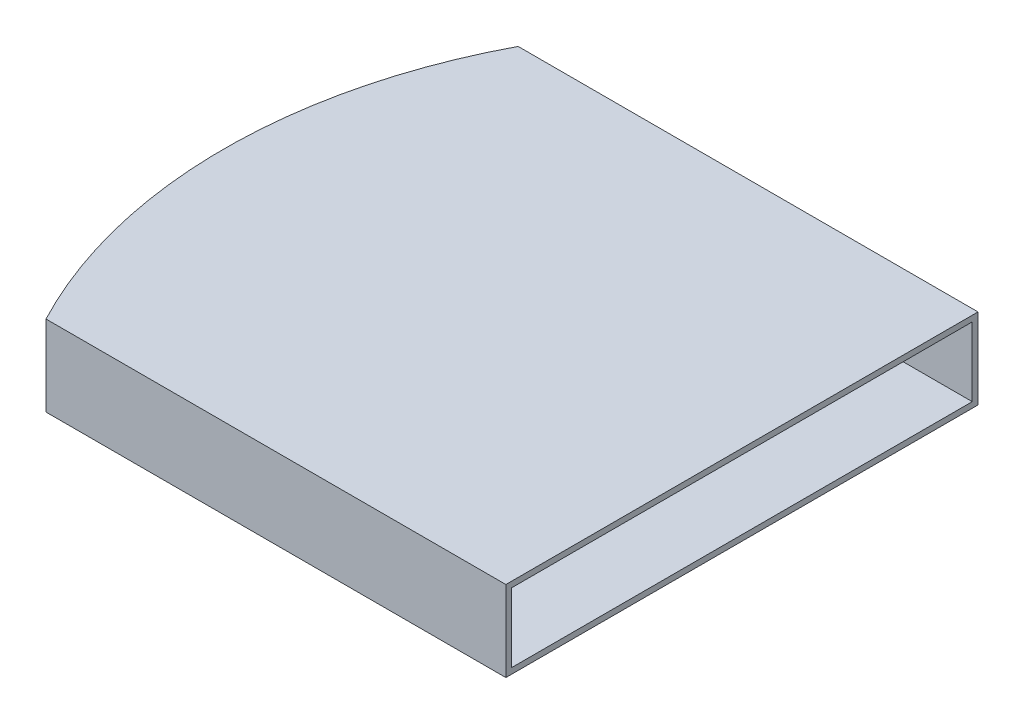
ISO-10303-21;
HEADER;
FILE_DESCRIPTION(('STEP AP214'),'2;1');
FILE_NAME('part.step','',(''),(''),'','','');
FILE_SCHEMA(('AUTOMOTIVE_DESIGN { 1 0 10303 214 1 1 1 1 }'));
ENDSEC;
DATA;
#1=APPLICATION_CONTEXT('core data for automotive mechanical design processes');
#2=APPLICATION_PROTOCOL_DEFINITION('international standard','automotive_design',2000,#1);
#3=PRODUCT_CONTEXT('',#1,'mechanical');
#4=PRODUCT('Part','Part','',(#3));
#5=PRODUCT_RELATED_PRODUCT_CATEGORY('part','',(#4));
#6=PRODUCT_DEFINITION_FORMATION('','',#4);
#7=PRODUCT_DEFINITION_CONTEXT('part definition',#1,'design');
#8=PRODUCT_DEFINITION('design','',#6,#7);
#9=PRODUCT_DEFINITION_SHAPE('','',#8);
#10=(LENGTH_UNIT() NAMED_UNIT(*) SI_UNIT(.MILLI.,.METRE.));
#11=(NAMED_UNIT(*) PLANE_ANGLE_UNIT() SI_UNIT($,.RADIAN.));
#12=(NAMED_UNIT(*) SI_UNIT($,.STERADIAN.) SOLID_ANGLE_UNIT());
#13=UNCERTAINTY_MEASURE_WITH_UNIT(LENGTH_MEASURE(1.E-05),#10,'distance_accuracy_value','');
#14=(GEOMETRIC_REPRESENTATION_CONTEXT(3) GLOBAL_UNCERTAINTY_ASSIGNED_CONTEXT((#13)) GLOBAL_UNIT_ASSIGNED_CONTEXT((#10,
#11,#12)) REPRESENTATION_CONTEXT('',''));
#15=CARTESIAN_POINT('',(0.,0.,0.));
#16=DIRECTION('',(0.,0.,1.));
#17=DIRECTION('',(1.,0.,0.));
#18=AXIS2_PLACEMENT_3D('',#15,#16,#17);
#19=CARTESIAN_POINT('',(-6.35000000000002,44.45,-130.175));
#20=DIRECTION('',(0.,-1.,0.));
#21=DIRECTION('',(0.,0.,-1.));
#22=AXIS2_PLACEMENT_3D('',#19,#20,#21);
#23=CYLINDRICAL_SURFACE('',#22,279.4);
#24=CARTESIAN_POINT('',(-6.35000000000002,0.,-130.175));
#25=DIRECTION('',(0.,1.,0.));
#26=DIRECTION('',(0.,0.,1.));
#27=AXIS2_PLACEMENT_3D('',#24,#25,#26);
#28=CIRCLE('',#27,279.4);
#29=CARTESIAN_POINT('',(-253.572226700999,0.,-260.35));
#30=VERTEX_POINT('',#29);
#31=CARTESIAN_POINT('',(-253.572226700999,0.,0.));
#32=VERTEX_POINT('',#31);
#33=EDGE_CURVE('E150',#30,#32,#28,.T.);
#34=ORIENTED_EDGE('',*,*,#33,.T.);
#35=DIRECTION('',(0.,-1.,0.));
#36=VECTOR('',#35,1.);
#37=CARTESIAN_POINT('',(-253.572226700999,44.45,0.));
#38=LINE('',#37,#36);
#39=CARTESIAN_POINT('',(-253.572226700999,44.45,0.));
#40=VERTEX_POINT('',#39);
#41=EDGE_CURVE('E183',#40,#32,#38,.T.);
#42=ORIENTED_EDGE('',*,*,#41,.F.);
#43=CARTESIAN_POINT('',(-6.35000000000002,44.45,-130.175));
#44=DIRECTION('',(0.,1.,0.));
#45=DIRECTION('',(0.,0.,1.));
#46=AXIS2_PLACEMENT_3D('',#43,#44,#45);
#47=CIRCLE('',#46,279.4);
#48=CARTESIAN_POINT('',(-253.572226700999,44.45,-260.35));
#49=VERTEX_POINT('',#48);
#50=EDGE_CURVE('E152',#49,#40,#47,.T.);
#51=ORIENTED_EDGE('',*,*,#50,.F.);
#52=DIRECTION('',(0.,-1.,0.));
#53=VECTOR('',#52,1.);
#54=CARTESIAN_POINT('',(-253.572226700999,44.45,-260.35));
#55=LINE('',#54,#53);
#56=EDGE_CURVE('E162',#49,#30,#55,.T.);
#57=ORIENTED_EDGE('',*,*,#56,.T.);
#58=EDGE_LOOP('',(#34,#42,#51,#57));
#59=FACE_BOUND('',#58,.T.);
#60=ADVANCED_FACE('F39',(#59),#23,.T.);
#61=CARTESIAN_POINT('',(-253.572226700999,44.45,0.));
#62=DIRECTION('',(0.,0.,-1.));
#63=DIRECTION('',(-1.,0.,0.));
#64=AXIS2_PLACEMENT_3D('',#61,#62,#63);
#65=PLANE('',#64);
#66=DIRECTION('',(1.,0.,0.));
#67=VECTOR('',#66,1.);
#68=CARTESIAN_POINT('',(-253.572226700999,0.,0.));
#69=LINE('',#68,#67);
#70=CARTESIAN_POINT('',(0.,0.,0.));
#71=VERTEX_POINT('',#70);
#72=EDGE_CURVE('E166',#32,#71,#69,.T.);
#73=ORIENTED_EDGE('',*,*,#72,.T.);
#74=DIRECTION('',(0.,-1.,0.));
#75=VECTOR('',#74,1.);
#76=CARTESIAN_POINT('',(0.,44.45,0.));
#77=LINE('',#76,#75);
#78=CARTESIAN_POINT('',(0.,44.45,0.));
#79=VERTEX_POINT('',#78);
#80=EDGE_CURVE('E179',#79,#71,#77,.T.);
#81=ORIENTED_EDGE('',*,*,#80,.F.);
#82=DIRECTION('',(1.,0.,0.));
#83=VECTOR('',#82,1.);
#84=CARTESIAN_POINT('',(-253.572226700999,44.45,0.));
#85=LINE('',#84,#83);
#86=EDGE_CURVE('E92',#40,#79,#85,.T.);
#87=ORIENTED_EDGE('',*,*,#86,.F.);
#88=ORIENTED_EDGE('',*,*,#41,.T.);
#89=EDGE_LOOP('',(#73,#81,#87,#88));
#90=FACE_BOUND('',#89,.T.);
#91=ADVANCED_FACE('F213',(#90),#65,.F.);
#92=CARTESIAN_POINT('',(0.,44.45,-260.35));
#93=DIRECTION('',(-1.,0.,0.));
#94=DIRECTION('',(0.,0.,1.));
#95=AXIS2_PLACEMENT_3D('',#92,#93,#94);
#96=PLANE('',#95);
#97=DIRECTION('',(0.,0.,-1.));
#98=VECTOR('',#97,1.);
#99=CARTESIAN_POINT('',(0.,41.275,-260.35));
#100=LINE('',#99,#98);
#101=CARTESIAN_POINT('',(0.,41.275,-3.17499999999998));
#102=VERTEX_POINT('',#101);
#103=CARTESIAN_POINT('',(0.,41.275,-257.175));
#104=VERTEX_POINT('',#103);
#105=EDGE_CURVE('E47',#102,#104,#100,.T.);
#106=ORIENTED_EDGE('',*,*,#105,.T.);
#107=DIRECTION('',(0.,-1.,0.));
#108=VECTOR('',#107,1.);
#109=CARTESIAN_POINT('',(0.,44.45,-257.175));
#110=LINE('',#109,#108);
#111=CARTESIAN_POINT('',(0.,3.175,-257.175));
#112=VERTEX_POINT('',#111);
#113=EDGE_CURVE('E11',#104,#112,#110,.T.);
#114=ORIENTED_EDGE('',*,*,#113,.T.);
#115=DIRECTION('',(0.,0.,1.));
#116=VECTOR('',#115,1.);
#117=CARTESIAN_POINT('',(0.,3.175,-260.35));
#118=LINE('',#117,#116);
#119=CARTESIAN_POINT('',(0.,3.175,-3.175));
#120=VERTEX_POINT('',#119);
#121=EDGE_CURVE('E189',#112,#120,#118,.T.);
#122=ORIENTED_EDGE('',*,*,#121,.T.);
#123=DIRECTION('',(0.,-1.,0.));
#124=VECTOR('',#123,1.);
#125=CARTESIAN_POINT('',(0.,44.45,-3.17499999999998));
#126=LINE('',#125,#124);
#127=EDGE_CURVE('E186',#102,#120,#126,.T.);
#128=ORIENTED_EDGE('',*,*,#127,.F.);
#129=EDGE_LOOP('',(#106,#114,#122,#128));
#130=FACE_BOUND('',#129,.T.);
#131=DIRECTION('',(0.,0.,-1.));
#132=VECTOR('',#131,1.);
#133=CARTESIAN_POINT('',(0.,0.,-260.35));
#134=LINE('',#133,#132);
#135=CARTESIAN_POINT('',(0.,0.,-260.35));
#136=VERTEX_POINT('',#135);
#137=EDGE_CURVE('E169',#71,#136,#134,.T.);
#138=ORIENTED_EDGE('',*,*,#137,.T.);
#139=DIRECTION('',(0.,-1.,0.));
#140=VECTOR('',#139,1.);
#141=CARTESIAN_POINT('',(0.,44.45,-260.35));
#142=LINE('',#141,#140);
#143=CARTESIAN_POINT('',(0.,44.45,-260.35));
#144=VERTEX_POINT('',#143);
#145=EDGE_CURVE('E176',#144,#136,#142,.T.);
#146=ORIENTED_EDGE('',*,*,#145,.F.);
#147=DIRECTION('',(0.,0.,-1.));
#148=VECTOR('',#147,1.);
#149=CARTESIAN_POINT('',(0.,44.45,-260.35));
#150=LINE('',#149,#148);
#151=EDGE_CURVE('E157',#79,#144,#150,.T.);
#152=ORIENTED_EDGE('',*,*,#151,.F.);
#153=ORIENTED_EDGE('',*,*,#80,.T.);
#154=EDGE_LOOP('',(#138,#146,#152,#153));
#155=FACE_BOUND('',#154,.T.);
#156=ADVANCED_FACE('F195',(#130,#155),#96,.F.);
#157=CARTESIAN_POINT('',(-253.572226700999,44.45,-260.35));
#158=DIRECTION('',(0.,0.,1.));
#159=DIRECTION('',(1.,0.,0.));
#160=AXIS2_PLACEMENT_3D('',#157,#158,#159);
#161=PLANE('',#160);
#162=DIRECTION('',(-1.,0.,0.));
#163=VECTOR('',#162,1.);
#164=CARTESIAN_POINT('',(-253.572226700999,0.,-260.35));
#165=LINE('',#164,#163);
#166=EDGE_CURVE('E84',#136,#30,#165,.T.);
#167=ORIENTED_EDGE('',*,*,#166,.T.);
#168=ORIENTED_EDGE('',*,*,#56,.F.);
#169=DIRECTION('',(-1.,0.,0.));
#170=VECTOR('',#169,1.);
#171=CARTESIAN_POINT('',(-253.572226700999,44.45,-260.35));
#172=LINE('',#171,#170);
#173=EDGE_CURVE('E63',#144,#49,#172,.T.);
#174=ORIENTED_EDGE('',*,*,#173,.F.);
#175=ORIENTED_EDGE('',*,*,#145,.T.);
#176=EDGE_LOOP('',(#167,#168,#174,#175));
#177=FACE_BOUND('',#176,.T.);
#178=ADVANCED_FACE('F227',(#177),#161,.F.);
#179=CARTESIAN_POINT('',(-6.35000000000002,44.45,-130.175));
#180=DIRECTION('',(0.,1.,0.));
#181=DIRECTION('',(0.,0.,1.));
#182=AXIS2_PLACEMENT_3D('',#179,#180,#181);
#183=PLANE('',#182);
#184=ORIENTED_EDGE('',*,*,#50,.T.);
#185=ORIENTED_EDGE('',*,*,#86,.T.);
#186=ORIENTED_EDGE('',*,*,#151,.T.);
#187=ORIENTED_EDGE('',*,*,#173,.T.);
#188=EDGE_LOOP('',(#184,#185,#186,#187));
#189=FACE_BOUND('',#188,.T.);
#190=ADVANCED_FACE('F225',(#189),#183,.T.);
#191=CARTESIAN_POINT('',(-6.35000000000002,0.,-130.175));
#192=DIRECTION('',(0.,1.,0.));
#193=DIRECTION('',(0.,0.,1.));
#194=AXIS2_PLACEMENT_3D('',#191,#192,#193);
#195=PLANE('',#194);
#196=ORIENTED_EDGE('',*,*,#33,.F.);
#197=ORIENTED_EDGE('',*,*,#166,.F.);
#198=ORIENTED_EDGE('',*,*,#137,.F.);
#199=ORIENTED_EDGE('',*,*,#72,.F.);
#200=EDGE_LOOP('',(#196,#197,#198,#199));
#201=FACE_BOUND('',#200,.T.);
#202=ADVANCED_FACE('F208',(#201),#195,.F.);
#203=CARTESIAN_POINT('',(-247.222226700999,41.275,-257.175));
#204=DIRECTION('',(0.,1.,0.));
#205=DIRECTION('',(0.,0.,1.));
#206=AXIS2_PLACEMENT_3D('',#203,#204,#205);
#207=PLANE('',#206);
#208=DIRECTION('',(-1.,0.,0.));
#209=VECTOR('',#208,1.);
#210=CARTESIAN_POINT('',(-247.222226700999,41.275,-3.175));
#211=LINE('',#210,#209);
#212=CARTESIAN_POINT('',(-247.222226700999,41.275,-3.175));
#213=VERTEX_POINT('',#212);
#214=EDGE_CURVE('E54',#102,#213,#211,.T.);
#215=ORIENTED_EDGE('',*,*,#214,.T.);
#216=DIRECTION('',(0.,0.,1.));
#217=VECTOR('',#216,1.);
#218=CARTESIAN_POINT('',(-247.222226700999,41.275,-257.175));
#219=LINE('',#218,#217);
#220=CARTESIAN_POINT('',(-247.222226700999,41.275,-257.175));
#221=VERTEX_POINT('',#220);
#222=EDGE_CURVE('E126',#221,#213,#219,.T.);
#223=ORIENTED_EDGE('',*,*,#222,.F.);
#224=DIRECTION('',(-1.,0.,0.));
#225=VECTOR('',#224,1.);
#226=CARTESIAN_POINT('',(-247.222226700999,41.275,-257.175));
#227=LINE('',#226,#225);
#228=EDGE_CURVE('E114',#104,#221,#227,.T.);
#229=ORIENTED_EDGE('',*,*,#228,.F.);
#230=ORIENTED_EDGE('',*,*,#105,.F.);
#231=EDGE_LOOP('',(#215,#223,#229,#230));
#232=FACE_BOUND('',#231,.T.);
#233=ADVANCED_FACE('F127',(#232),#207,.F.);
#234=CARTESIAN_POINT('',(-215.252530753144,3.175,-257.175));
#235=DIRECTION('',(0.,-1.,0.));
#236=DIRECTION('',(0.,0.,-1.));
#237=AXIS2_PLACEMENT_3D('',#234,#235,#236);
#238=PLANE('',#237);
#239=DIRECTION('',(1.,0.,0.));
#240=VECTOR('',#239,1.);
#241=CARTESIAN_POINT('',(-215.252530753144,3.175,-257.175));
#242=LINE('',#241,#240);
#243=CARTESIAN_POINT('',(-215.252530753144,3.175,-257.175));
#244=VERTEX_POINT('',#243);
#245=EDGE_CURVE('E132',#244,#112,#242,.T.);
#246=ORIENTED_EDGE('',*,*,#245,.F.);
#247=DIRECTION('',(0.,0.,1.));
#248=VECTOR('',#247,1.);
#249=CARTESIAN_POINT('',(-215.252530753144,3.175,-257.175));
#250=LINE('',#249,#248);
#251=CARTESIAN_POINT('',(-215.252530753144,3.175,-3.175));
#252=VERTEX_POINT('',#251);
#253=EDGE_CURVE('E131',#244,#252,#250,.T.);
#254=ORIENTED_EDGE('',*,*,#253,.T.);
#255=DIRECTION('',(1.,0.,0.));
#256=VECTOR('',#255,1.);
#257=CARTESIAN_POINT('',(-215.252530753144,3.175,-3.175));
#258=LINE('',#257,#256);
#259=EDGE_CURVE('E123',#252,#120,#258,.T.);
#260=ORIENTED_EDGE('',*,*,#259,.T.);
#261=ORIENTED_EDGE('',*,*,#121,.F.);
#262=EDGE_LOOP('',(#246,#254,#260,#261));
#263=FACE_BOUND('',#262,.T.);
#264=ADVANCED_FACE('F200',(#263),#238,.F.);
#265=CARTESIAN_POINT('',(0.,0.,-257.175));
#266=DIRECTION('',(0.,0.,-1.));
#267=DIRECTION('',(-1.,0.,0.));
#268=AXIS2_PLACEMENT_3D('',#265,#266,#267);
#269=PLANE('',#268);
#270=ORIENTED_EDGE('',*,*,#228,.T.);
#271=DIRECTION('',(0.642787609686538,-0.766044443118979,0.));
#272=VECTOR('',#271,1.);
#273=CARTESIAN_POINT('',(-247.222226700999,41.275,-257.175));
#274=LINE('',#273,#272);
#275=EDGE_CURVE('E119',#221,#244,#274,.T.);
#276=ORIENTED_EDGE('',*,*,#275,.T.);
#277=ORIENTED_EDGE('',*,*,#245,.T.);
#278=ORIENTED_EDGE('',*,*,#113,.F.);
#279=EDGE_LOOP('',(#270,#276,#277,#278));
#280=FACE_BOUND('',#279,.T.);
#281=ADVANCED_FACE('F116',(#280),#269,.F.);
#282=CARTESIAN_POINT('',(0.,0.,-3.175));
#283=DIRECTION('',(0.,0.,-1.));
#284=DIRECTION('',(-1.,0.,0.));
#285=AXIS2_PLACEMENT_3D('',#282,#283,#284);
#286=PLANE('',#285);
#287=ORIENTED_EDGE('',*,*,#127,.T.);
#288=ORIENTED_EDGE('',*,*,#259,.F.);
#289=DIRECTION('',(0.642787609686538,-0.766044443118979,0.));
#290=VECTOR('',#289,1.);
#291=CARTESIAN_POINT('',(-247.222226700999,41.275,-3.175));
#292=LINE('',#291,#290);
#293=EDGE_CURVE('E143',#213,#252,#292,.T.);
#294=ORIENTED_EDGE('',*,*,#293,.F.);
#295=ORIENTED_EDGE('',*,*,#214,.F.);
#296=EDGE_LOOP('',(#287,#288,#294,#295));
#297=FACE_BOUND('',#296,.T.);
#298=ADVANCED_FACE('F198',(#297),#286,.T.);
#299=CARTESIAN_POINT('',(-247.222226700999,41.275,-257.175));
#300=DIRECTION('',(-0.766044443118979,-0.642787609686538,0.));
#301=DIRECTION('',(0.642787609686538,-0.766044443118979,0.));
#302=AXIS2_PLACEMENT_3D('',#299,#300,#301);
#303=PLANE('',#302);
#304=ORIENTED_EDGE('',*,*,#293,.T.);
#305=ORIENTED_EDGE('',*,*,#253,.F.);
#306=ORIENTED_EDGE('',*,*,#275,.F.);
#307=ORIENTED_EDGE('',*,*,#222,.T.);
#308=EDGE_LOOP('',(#304,#305,#306,#307));
#309=FACE_BOUND('',#308,.T.);
#310=ADVANCED_FACE('F134',(#309),#303,.F.);
#311=CLOSED_SHELL('',(#60,#91,#156,#178,#190,#202,#233,#264,#281,#298,#310));
#312=MANIFOLD_SOLID_BREP('B2',#311);
#313=ADVANCED_BREP_SHAPE_REPRESENTATION('',(#18,#312),#14);
#314=SHAPE_DEFINITION_REPRESENTATION(#9,#313);
ENDSEC;
END-ISO-10303-21;
